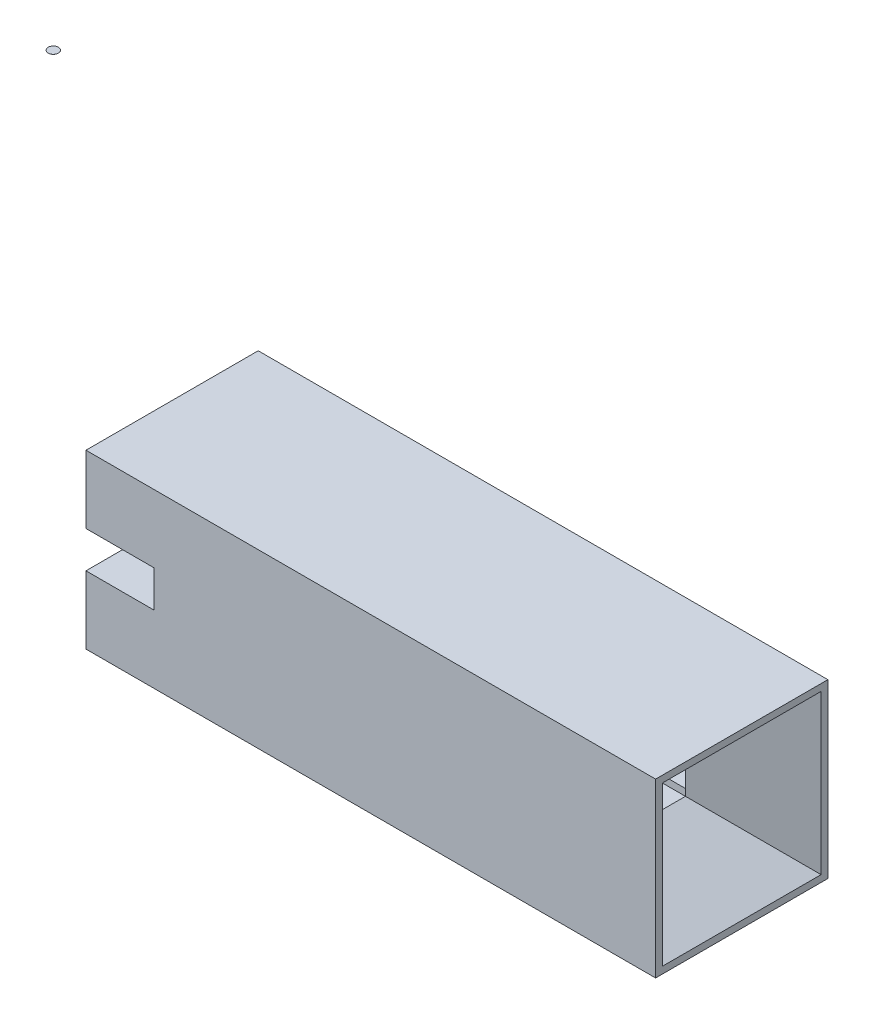
ISO-10303-21;
HEADER;
FILE_DESCRIPTION(('STEP AP214'),'2;1');
FILE_NAME('part.step','',(''),(''),'','','');
FILE_SCHEMA(('AUTOMOTIVE_DESIGN { 1 0 10303 214 1 1 1 1 }'));
ENDSEC;
DATA;
#1=APPLICATION_CONTEXT('core data for automotive mechanical design processes');
#2=APPLICATION_PROTOCOL_DEFINITION('international standard','automotive_design',2000,#1);
#3=PRODUCT_CONTEXT('',#1,'mechanical');
#4=PRODUCT('Part','Part','',(#3));
#5=PRODUCT_RELATED_PRODUCT_CATEGORY('part','',(#4));
#6=PRODUCT_DEFINITION_FORMATION('','',#4);
#7=PRODUCT_DEFINITION_CONTEXT('part definition',#1,'design');
#8=PRODUCT_DEFINITION('design','',#6,#7);
#9=PRODUCT_DEFINITION_SHAPE('','',#8);
#10=(LENGTH_UNIT() NAMED_UNIT(*) SI_UNIT(.MILLI.,.METRE.));
#11=(NAMED_UNIT(*) PLANE_ANGLE_UNIT() SI_UNIT($,.RADIAN.));
#12=(NAMED_UNIT(*) SI_UNIT($,.STERADIAN.) SOLID_ANGLE_UNIT());
#13=UNCERTAINTY_MEASURE_WITH_UNIT(LENGTH_MEASURE(1.E-05),#10,'distance_accuracy_value','');
#14=(GEOMETRIC_REPRESENTATION_CONTEXT(3) GLOBAL_UNCERTAINTY_ASSIGNED_CONTEXT((#13)) GLOBAL_UNIT_ASSIGNED_CONTEXT((#10,
#11,#12)) REPRESENTATION_CONTEXT('',''));
#15=CARTESIAN_POINT('',(0.,0.,0.));
#16=DIRECTION('',(0.,0.,1.));
#17=DIRECTION('',(1.,0.,0.));
#18=AXIS2_PLACEMENT_3D('',#15,#16,#17);
#19=CARTESIAN_POINT('',(-1.75128642374789,6.13796437451679,1.2700146680412));
#20=DIRECTION('',(0.,-1.,0.));
#21=DIRECTION('',(0.,0.,-1.));
#22=AXIS2_PLACEMENT_3D('',#19,#20,#21);
#23=CYLINDRICAL_SURFACE('',#22,0.0749998832872016);
#24=CARTESIAN_POINT('',(-1.75128642374789,6.13796437451679,1.2700146680412));
#25=DIRECTION('',(-1.06457269215265E-11,0.999999999994676,3.26329213274641E-06));
#26=DIRECTION('',(0.,-3.26329213274641E-06,0.999999999994675));
#27=AXIS2_PLACEMENT_3D('',#24,#25,#26);
#28=CIRCLE('',#27,0.0749998832872016);
#29=CARTESIAN_POINT('',(-1.75128642374789,6.13796412977026,1.345014551328));
#30=VERTEX_POINT('',#29);
#31=EDGE_CURVE('E11',#30,#30,#28,.T.);
#32=ORIENTED_EDGE('',*,*,#31,.F.);
#33=EDGE_LOOP('',(#32));
#34=FACE_BOUND('',#33,.T.);
#35=CARTESIAN_POINT('',(-1.75128642374789,6.13696437451679,1.2700146680412));
#36=DIRECTION('',(-1.06457269215265E-11,0.999999999994676,3.26329213274641E-06));
#37=DIRECTION('',(0.,-3.26329213274641E-06,0.999999999994675));
#38=AXIS2_PLACEMENT_3D('',#35,#36,#37);
#39=CIRCLE('',#38,0.0749998832872016);
#40=CARTESIAN_POINT('',(-1.75128642374789,6.13696412977026,1.345014551328));
#41=VERTEX_POINT('',#40);
#42=EDGE_CURVE('E54',#41,#41,#39,.T.);
#43=ORIENTED_EDGE('',*,*,#42,.T.);
#44=EDGE_LOOP('',(#43));
#45=FACE_BOUND('',#44,.T.);
#46=ADVANCED_FACE('F51',(#34,#45),#23,.T.);
#47=CARTESIAN_POINT('',(-1.75128642374789,6.13796437451679,1.2700146680412));
#48=DIRECTION('',(-1.06457269215265E-11,0.999999999994676,3.26329213274641E-06));
#49=DIRECTION('',(0.,-3.26329213274641E-06,0.999999999994675));
#50=AXIS2_PLACEMENT_3D('',#47,#48,#49);
#51=PLANE('',#50);
#52=ORIENTED_EDGE('',*,*,#31,.T.);
#53=EDGE_LOOP('',(#52));
#54=FACE_BOUND('',#53,.T.);
#55=ADVANCED_FACE('F66',(#54),#51,.T.);
#56=CARTESIAN_POINT('',(-1.75128642374789,6.13696437451679,1.2700146680412));
#57=DIRECTION('',(-1.06457269215265E-11,0.999999999994676,3.26329213274641E-06));
#58=DIRECTION('',(0.,-3.26329213274641E-06,0.999999999994675));
#59=AXIS2_PLACEMENT_3D('',#56,#57,#58);
#60=PLANE('',#59);
#61=ORIENTED_EDGE('',*,*,#42,.F.);
#62=EDGE_LOOP('',(#61));
#63=FACE_BOUND('',#62,.T.);
#64=ADVANCED_FACE('F64',(#63),#60,.F.);
#65=CLOSED_SHELL('',(#46,#55,#64));
#66=MANIFOLD_SOLID_BREP('B2',#65);
#67=CARTESIAN_POINT('',(-0.000999999999999265,1.64,1.64));
#68=DIRECTION('',(0.,0.,1.));
#69=DIRECTION('',(1.,0.,0.));
#70=AXIS2_PLACEMENT_3D('',#67,#68,#69);
#71=PLANE('',#70);
#72=DIRECTION('',(1.,0.,0.));
#73=VECTOR('',#72,1.);
#74=CARTESIAN_POINT('',(-0.000999999999999265,1.,1.64));
#75=LINE('',#74,#73);
#76=CARTESIAN_POINT('',(0.,1.,1.64));
#77=VERTEX_POINT('',#76);
#78=CARTESIAN_POINT('',(7.2,1.,1.64));
#79=VERTEX_POINT('',#78);
#80=EDGE_CURVE('E330',#77,#79,#75,.T.);
#81=ORIENTED_EDGE('',*,*,#80,.T.);
#82=DIRECTION('',(0.,-1.,0.));
#83=VECTOR('',#82,1.);
#84=CARTESIAN_POINT('',(7.2,1.64000000000001,1.64));
#85=LINE('',#84,#83);
#86=CARTESIAN_POINT('',(7.20000000000001,0.9,1.64));
#87=VERTEX_POINT('',#86);
#88=EDGE_CURVE('E421',#79,#87,#85,.T.);
#89=ORIENTED_EDGE('',*,*,#88,.T.);
#90=DIRECTION('',(1.,0.,0.));
#91=VECTOR('',#90,1.);
#92=CARTESIAN_POINT('',(-0.000999999999999265,0.9,1.64));
#93=LINE('',#92,#91);
#94=CARTESIAN_POINT('',(0.,0.9,1.64));
#95=VERTEX_POINT('',#94);
#96=EDGE_CURVE('E358',#95,#87,#93,.T.);
#97=ORIENTED_EDGE('',*,*,#96,.F.);
#98=DIRECTION('',(0.,1.,0.));
#99=VECTOR('',#98,1.);
#100=CARTESIAN_POINT('',(0.,1.64,1.64));
#101=LINE('',#100,#99);
#102=EDGE_CURVE('E354',#95,#77,#101,.T.);
#103=ORIENTED_EDGE('',*,*,#102,.T.);
#104=EDGE_LOOP('',(#81,#89,#97,#103));
#105=FACE_BOUND('',#104,.T.);
#106=ADVANCED_FACE('F97',(#105),#71,.F.);
#107=CARTESIAN_POINT('',(-0.000999999999999265,1.64,0.9));
#108=DIRECTION('',(0.,0.,-1.));
#109=DIRECTION('',(0.,1.,0.));
#110=AXIS2_PLACEMENT_3D('',#107,#108,#109);
#111=PLANE('',#110);
#112=DIRECTION('',(0.,1.,0.));
#113=VECTOR('',#112,1.);
#114=CARTESIAN_POINT('',(7.2,1.64000000000001,0.9));
#115=LINE('',#114,#113);
#116=CARTESIAN_POINT('',(7.2,0.900000000000011,0.9));
#117=VERTEX_POINT('',#116);
#118=CARTESIAN_POINT('',(7.2,1.,0.900000000000001));
#119=VERTEX_POINT('',#118);
#120=EDGE_CURVE('E443',#117,#119,#115,.T.);
#121=ORIENTED_EDGE('',*,*,#120,.T.);
#122=DIRECTION('',(-1.,0.,0.));
#123=VECTOR('',#122,1.);
#124=CARTESIAN_POINT('',(-0.000999999999999265,1.,0.9));
#125=LINE('',#124,#123);
#126=CARTESIAN_POINT('',(0.,1.,0.9));
#127=VERTEX_POINT('',#126);
#128=EDGE_CURVE('E106',#119,#127,#125,.T.);
#129=ORIENTED_EDGE('',*,*,#128,.T.);
#130=DIRECTION('',(0.,-1.,0.));
#131=VECTOR('',#130,1.);
#132=CARTESIAN_POINT('',(0.,1.64,0.9));
#133=LINE('',#132,#131);
#134=CARTESIAN_POINT('',(0.,0.900000000000011,0.9));
#135=VERTEX_POINT('',#134);
#136=EDGE_CURVE('E349',#127,#135,#133,.T.);
#137=ORIENTED_EDGE('',*,*,#136,.T.);
#138=DIRECTION('',(1.,0.,0.));
#139=VECTOR('',#138,1.);
#140=CARTESIAN_POINT('',(-0.000999999999999265,0.900000000000011,0.9));
#141=LINE('',#140,#139);
#142=EDGE_CURVE('E367',#135,#117,#141,.T.);
#143=ORIENTED_EDGE('',*,*,#142,.T.);
#144=EDGE_LOOP('',(#121,#129,#137,#143));
#145=FACE_BOUND('',#144,.T.);
#146=ADVANCED_FACE('F467',(#145),#111,.F.);
#147=CARTESIAN_POINT('',(0.,0.,2.54));
#148=DIRECTION('',(1.,0.,0.));
#149=DIRECTION('',(0.,0.,-1.));
#150=AXIS2_PLACEMENT_3D('',#147,#148,#149);
#151=PLANE('',#150);
#152=DIRECTION('',(0.,-1.,0.));
#153=VECTOR('',#152,1.);
#154=CARTESIAN_POINT('',(0.,0.,0.));
#155=LINE('',#154,#153);
#156=CARTESIAN_POINT('',(0.,2.54,0.));
#157=VERTEX_POINT('',#156);
#158=CARTESIAN_POINT('',(0.,1.54,0.));
#159=VERTEX_POINT('',#158);
#160=EDGE_CURVE('E393',#157,#159,#155,.T.);
#161=ORIENTED_EDGE('',*,*,#160,.T.);
#162=DIRECTION('',(0.,0.,-1.));
#163=VECTOR('',#162,1.);
#164=CARTESIAN_POINT('',(0.,1.54,0.));
#165=LINE('',#164,#163);
#166=CARTESIAN_POINT('',(0.,1.54,0.9));
#167=VERTEX_POINT('',#166);
#168=EDGE_CURVE('E323',#167,#159,#165,.T.);
#169=ORIENTED_EDGE('',*,*,#168,.F.);
#170=CARTESIAN_POINT('',(0.,1.64,0.9));
#171=VERTEX_POINT('',#170);
#172=EDGE_CURVE('E344',#171,#167,#133,.T.);
#173=ORIENTED_EDGE('',*,*,#172,.F.);
#174=DIRECTION('',(0.,0.,-1.));
#175=VECTOR('',#174,1.);
#176=CARTESIAN_POINT('',(0.,1.64,1.64));
#177=LINE('',#176,#175);
#178=CARTESIAN_POINT('',(0.,1.64,1.64));
#179=VERTEX_POINT('',#178);
#180=EDGE_CURVE('E348',#179,#171,#177,.T.);
#181=ORIENTED_EDGE('',*,*,#180,.F.);
#182=CARTESIAN_POINT('',(0.,1.54,1.64));
#183=VERTEX_POINT('',#182);
#184=EDGE_CURVE('E353',#183,#179,#101,.T.);
#185=ORIENTED_EDGE('',*,*,#184,.F.);
#186=CARTESIAN_POINT('',(0.,1.54,2.54));
#187=VERTEX_POINT('',#186);
#188=EDGE_CURVE('E307',#187,#183,#165,.T.);
#189=ORIENTED_EDGE('',*,*,#188,.F.);
#190=DIRECTION('',(0.,-1.,0.));
#191=VECTOR('',#190,1.);
#192=CARTESIAN_POINT('',(0.,0.,2.54));
#193=LINE('',#192,#191);
#194=CARTESIAN_POINT('',(0.,2.54,2.54));
#195=VERTEX_POINT('',#194);
#196=EDGE_CURVE('E378',#195,#187,#193,.T.);
#197=ORIENTED_EDGE('',*,*,#196,.F.);
#198=DIRECTION('',(0.,0.,-1.));
#199=VECTOR('',#198,1.);
#200=CARTESIAN_POINT('',(0.,2.54,2.54));
#201=LINE('',#200,#199);
#202=EDGE_CURVE('E392',#195,#157,#201,.T.);
#203=ORIENTED_EDGE('',*,*,#202,.T.);
#204=EDGE_LOOP('',(#161,#169,#173,#181,#185,#189,#197,#203));
#205=FACE_BOUND('',#204,.T.);
#206=ADVANCED_FACE('F556',(#205),#151,.F.);
#207=CARTESIAN_POINT('',(0.,1.,2.54));
#208=VERTEX_POINT('',#207);
#209=CARTESIAN_POINT('',(0.,0.,2.54));
#210=VERTEX_POINT('',#209);
#211=EDGE_CURVE('E383',#208,#210,#193,.T.);
#212=ORIENTED_EDGE('',*,*,#211,.F.);
#213=DIRECTION('',(0.,0.,1.));
#214=VECTOR('',#213,1.);
#215=CARTESIAN_POINT('',(0.,1.,0.));
#216=LINE('',#215,#214);
#217=EDGE_CURVE('E301',#77,#208,#216,.T.);
#218=ORIENTED_EDGE('',*,*,#217,.F.);
#219=ORIENTED_EDGE('',*,*,#102,.F.);
#220=DIRECTION('',(0.,0.,1.));
#221=VECTOR('',#220,1.);
#222=CARTESIAN_POINT('',(0.,0.9,1.64));
#223=LINE('',#222,#221);
#224=EDGE_CURVE('E363',#135,#95,#223,.T.);
#225=ORIENTED_EDGE('',*,*,#224,.F.);
#226=ORIENTED_EDGE('',*,*,#136,.F.);
#227=CARTESIAN_POINT('',(0.,1.,0.));
#228=VERTEX_POINT('',#227);
#229=EDGE_CURVE('E320',#228,#127,#216,.T.);
#230=ORIENTED_EDGE('',*,*,#229,.F.);
#231=CARTESIAN_POINT('',(0.,0.,0.));
#232=VERTEX_POINT('',#231);
#233=EDGE_CURVE('E377',#228,#232,#155,.T.);
#234=ORIENTED_EDGE('',*,*,#233,.T.);
#235=DIRECTION('',(0.,0.,-1.));
#236=VECTOR('',#235,1.);
#237=CARTESIAN_POINT('',(0.,0.,2.54));
#238=LINE('',#237,#236);
#239=EDGE_CURVE('E417',#210,#232,#238,.T.);
#240=ORIENTED_EDGE('',*,*,#239,.F.);
#241=EDGE_LOOP('',(#212,#218,#219,#225,#226,#230,#234,#240));
#242=FACE_BOUND('',#241,.T.);
#243=ADVANCED_FACE('F476',(#242),#151,.F.);
#244=CARTESIAN_POINT('',(0.,0.,2.54));
#245=DIRECTION('',(0.,1.,0.));
#246=DIRECTION('',(0.,0.,1.));
#247=AXIS2_PLACEMENT_3D('',#244,#245,#246);
#248=PLANE('',#247);
#249=DIRECTION('',(1.,0.,0.));
#250=VECTOR('',#249,1.);
#251=CARTESIAN_POINT('',(0.,0.,0.));
#252=LINE('',#251,#250);
#253=CARTESIAN_POINT('',(8.4,0.,0.));
#254=VERTEX_POINT('',#253);
#255=EDGE_CURVE('E397',#232,#254,#252,.T.);
#256=ORIENTED_EDGE('',*,*,#255,.T.);
#257=DIRECTION('',(0.,0.,-1.));
#258=VECTOR('',#257,1.);
#259=CARTESIAN_POINT('',(8.4,0.,2.54));
#260=LINE('',#259,#258);
#261=CARTESIAN_POINT('',(8.4,0.,2.54));
#262=VERTEX_POINT('',#261);
#263=EDGE_CURVE('E413',#262,#254,#260,.T.);
#264=ORIENTED_EDGE('',*,*,#263,.F.);
#265=DIRECTION('',(1.,0.,0.));
#266=VECTOR('',#265,1.);
#267=CARTESIAN_POINT('',(0.,0.,2.54));
#268=LINE('',#267,#266);
#269=EDGE_CURVE('E382',#210,#262,#268,.T.);
#270=ORIENTED_EDGE('',*,*,#269,.F.);
#271=ORIENTED_EDGE('',*,*,#239,.T.);
#272=EDGE_LOOP('',(#256,#264,#270,#271));
#273=FACE_BOUND('',#272,.T.);
#274=ADVANCED_FACE('F543',(#273),#248,.F.);
#275=CARTESIAN_POINT('',(8.4,0.,2.54));
#276=DIRECTION('',(-1.,0.,0.));
#277=DIRECTION('',(0.,-1.,0.));
#278=AXIS2_PLACEMENT_3D('',#275,#276,#277);
#279=PLANE('',#278);
#280=DIRECTION('',(0.,0.,1.));
#281=VECTOR('',#280,1.);
#282=CARTESIAN_POINT('',(8.4,0.09999999999999,2.54));
#283=LINE('',#282,#281);
#284=CARTESIAN_POINT('',(8.4,0.100000000000028,0.100000000000002));
#285=VERTEX_POINT('',#284);
#286=CARTESIAN_POINT('',(8.4,0.0999999999999915,2.44));
#287=VERTEX_POINT('',#286);
#288=EDGE_CURVE('E433',#285,#287,#283,.T.);
#289=ORIENTED_EDGE('',*,*,#288,.T.);
#290=DIRECTION('',(0.,1.,0.));
#291=VECTOR('',#290,1.);
#292=CARTESIAN_POINT('',(8.4,0.,2.44));
#293=LINE('',#292,#291);
#294=CARTESIAN_POINT('',(8.4,2.44,2.44));
#295=VERTEX_POINT('',#294);
#296=EDGE_CURVE('E436',#287,#295,#293,.T.);
#297=ORIENTED_EDGE('',*,*,#296,.T.);
#298=DIRECTION('',(0.,0.,-1.));
#299=VECTOR('',#298,1.);
#300=CARTESIAN_POINT('',(8.4,2.44,2.54));
#301=LINE('',#300,#299);
#302=CARTESIAN_POINT('',(8.4,2.44,0.100000000000002));
#303=VERTEX_POINT('',#302);
#304=EDGE_CURVE('E426',#295,#303,#301,.T.);
#305=ORIENTED_EDGE('',*,*,#304,.T.);
#306=DIRECTION('',(0.,-1.,0.));
#307=VECTOR('',#306,1.);
#308=CARTESIAN_POINT('',(8.4,0.,0.100000000000002));
#309=LINE('',#308,#307);
#310=EDGE_CURVE('E430',#303,#285,#309,.T.);
#311=ORIENTED_EDGE('',*,*,#310,.T.);
#312=EDGE_LOOP('',(#289,#297,#305,#311));
#313=FACE_BOUND('',#312,.T.);
#314=DIRECTION('',(0.,1.,0.));
#315=VECTOR('',#314,1.);
#316=CARTESIAN_POINT('',(8.4,0.,0.));
#317=LINE('',#316,#315);
#318=CARTESIAN_POINT('',(8.4,2.54,0.));
#319=VERTEX_POINT('',#318);
#320=EDGE_CURVE('E400',#254,#319,#317,.T.);
#321=ORIENTED_EDGE('',*,*,#320,.T.);
#322=DIRECTION('',(0.,0.,-1.));
#323=VECTOR('',#322,1.);
#324=CARTESIAN_POINT('',(8.4,2.54,2.54));
#325=LINE('',#324,#323);
#326=CARTESIAN_POINT('',(8.4,2.54,2.54));
#327=VERTEX_POINT('',#326);
#328=EDGE_CURVE('E409',#327,#319,#325,.T.);
#329=ORIENTED_EDGE('',*,*,#328,.F.);
#330=DIRECTION('',(0.,1.,0.));
#331=VECTOR('',#330,1.);
#332=CARTESIAN_POINT('',(8.4,0.,2.54));
#333=LINE('',#332,#331);
#334=EDGE_CURVE('E386',#262,#327,#333,.T.);
#335=ORIENTED_EDGE('',*,*,#334,.F.);
#336=ORIENTED_EDGE('',*,*,#263,.T.);
#337=EDGE_LOOP('',(#321,#329,#335,#336));
#338=FACE_BOUND('',#337,.T.);
#339=ADVANCED_FACE('F550',(#313,#338),#279,.F.);
#340=CARTESIAN_POINT('',(0.,2.54,2.54));
#341=DIRECTION('',(0.,-1.,0.));
#342=DIRECTION('',(0.,0.,-1.));
#343=AXIS2_PLACEMENT_3D('',#340,#341,#342);
#344=PLANE('',#343);
#345=DIRECTION('',(-1.,0.,0.));
#346=VECTOR('',#345,1.);
#347=CARTESIAN_POINT('',(0.,2.54,0.));
#348=LINE('',#347,#346);
#349=EDGE_CURVE('E403',#319,#157,#348,.T.);
#350=ORIENTED_EDGE('',*,*,#349,.T.);
#351=ORIENTED_EDGE('',*,*,#202,.F.);
#352=DIRECTION('',(-1.,0.,0.));
#353=VECTOR('',#352,1.);
#354=CARTESIAN_POINT('',(0.,2.54,2.54));
#355=LINE('',#354,#353);
#356=EDGE_CURVE('E389',#327,#195,#355,.T.);
#357=ORIENTED_EDGE('',*,*,#356,.F.);
#358=ORIENTED_EDGE('',*,*,#328,.T.);
#359=EDGE_LOOP('',(#350,#351,#357,#358));
#360=FACE_BOUND('',#359,.T.);
#361=ADVANCED_FACE('F554',(#360),#344,.F.);
#362=CARTESIAN_POINT('',(0.,0.,2.54));
#363=DIRECTION('',(0.,0.,-1.));
#364=DIRECTION('',(-1.,0.,0.));
#365=AXIS2_PLACEMENT_3D('',#362,#363,#364);
#366=PLANE('',#365);
#367=ORIENTED_EDGE('',*,*,#196,.T.);
#368=DIRECTION('',(-1.,0.,0.));
#369=VECTOR('',#368,1.);
#370=CARTESIAN_POINT('',(1.,1.54,2.54));
#371=LINE('',#370,#369);
#372=CARTESIAN_POINT('',(1.,1.54,2.54));
#373=VERTEX_POINT('',#372);
#374=EDGE_CURVE('E331',#373,#187,#371,.T.);
#375=ORIENTED_EDGE('',*,*,#374,.F.);
#376=DIRECTION('',(0.,1.,0.));
#377=VECTOR('',#376,1.);
#378=CARTESIAN_POINT('',(1.,1.54,2.54));
#379=LINE('',#378,#377);
#380=CARTESIAN_POINT('',(1.,1.,2.54));
#381=VERTEX_POINT('',#380);
#382=EDGE_CURVE('E312',#381,#373,#379,.T.);
#383=ORIENTED_EDGE('',*,*,#382,.F.);
#384=DIRECTION('',(-1.,0.,0.));
#385=VECTOR('',#384,1.);
#386=CARTESIAN_POINT('',(1.,1.,2.54));
#387=LINE('',#386,#385);
#388=EDGE_CURVE('E334',#381,#208,#387,.T.);
#389=ORIENTED_EDGE('',*,*,#388,.T.);
#390=ORIENTED_EDGE('',*,*,#211,.T.);
#391=ORIENTED_EDGE('',*,*,#269,.T.);
#392=ORIENTED_EDGE('',*,*,#334,.T.);
#393=ORIENTED_EDGE('',*,*,#356,.T.);
#394=EDGE_LOOP('',(#367,#375,#383,#389,#390,#391,#392,#393));
#395=FACE_BOUND('',#394,.T.);
#396=ADVANCED_FACE('F537',(#395),#366,.F.);
#397=CARTESIAN_POINT('',(0.,0.,0.));
#398=DIRECTION('',(0.,0.,-1.));
#399=DIRECTION('',(-1.,0.,0.));
#400=AXIS2_PLACEMENT_3D('',#397,#398,#399);
#401=PLANE('',#400);
#402=DIRECTION('',(-1.,0.,0.));
#403=VECTOR('',#402,1.);
#404=CARTESIAN_POINT('',(1.,1.54,0.));
#405=LINE('',#404,#403);
#406=CARTESIAN_POINT('',(1.,1.54,0.));
#407=VERTEX_POINT('',#406);
#408=EDGE_CURVE('E326',#407,#159,#405,.T.);
#409=ORIENTED_EDGE('',*,*,#408,.T.);
#410=ORIENTED_EDGE('',*,*,#160,.F.);
#411=ORIENTED_EDGE('',*,*,#349,.F.);
#412=ORIENTED_EDGE('',*,*,#320,.F.);
#413=ORIENTED_EDGE('',*,*,#255,.F.);
#414=ORIENTED_EDGE('',*,*,#233,.F.);
#415=DIRECTION('',(-1.,0.,0.));
#416=VECTOR('',#415,1.);
#417=CARTESIAN_POINT('',(1.,1.,0.));
#418=LINE('',#417,#416);
#419=CARTESIAN_POINT('',(1.,1.,0.));
#420=VERTEX_POINT('',#419);
#421=EDGE_CURVE('E319',#420,#228,#418,.T.);
#422=ORIENTED_EDGE('',*,*,#421,.F.);
#423=DIRECTION('',(0.,-1.,0.));
#424=VECTOR('',#423,1.);
#425=CARTESIAN_POINT('',(1.,1.54,0.));
#426=LINE('',#425,#424);
#427=EDGE_CURVE('E302',#407,#420,#426,.T.);
#428=ORIENTED_EDGE('',*,*,#427,.F.);
#429=EDGE_LOOP('',(#409,#410,#411,#412,#413,#414,#422,#428));
#430=FACE_BOUND('',#429,.T.);
#431=ADVANCED_FACE('F499',(#430),#401,.T.);
#432=CARTESIAN_POINT('',(7.2,1.64,1.64));
#433=VERTEX_POINT('',#432);
#434=CARTESIAN_POINT('',(7.2,1.54,1.64));
#435=VERTEX_POINT('',#434);
#436=EDGE_CURVE('E422',#433,#435,#85,.T.);
#437=ORIENTED_EDGE('',*,*,#436,.T.);
#438=DIRECTION('',(-1.,0.,0.));
#439=VECTOR('',#438,1.);
#440=CARTESIAN_POINT('',(-0.000999999999999265,1.54,1.64));
#441=LINE('',#440,#439);
#442=EDGE_CURVE('E260',#435,#183,#441,.T.);
#443=ORIENTED_EDGE('',*,*,#442,.T.);
#444=ORIENTED_EDGE('',*,*,#184,.T.);
#445=DIRECTION('',(1.,0.,0.));
#446=VECTOR('',#445,1.);
#447=CARTESIAN_POINT('',(-0.000999999999999265,1.64,1.64));
#448=LINE('',#447,#446);
#449=EDGE_CURVE('E359',#179,#433,#448,.T.);
#450=ORIENTED_EDGE('',*,*,#449,.T.);
#451=EDGE_LOOP('',(#437,#443,#444,#450));
#452=FACE_BOUND('',#451,.T.);
#453=ADVANCED_FACE('F523',(#452),#71,.F.);
#454=CARTESIAN_POINT('',(-0.000999999999999265,1.64,1.64));
#455=DIRECTION('',(0.,1.,0.));
#456=DIRECTION('',(0.,0.,1.));
#457=AXIS2_PLACEMENT_3D('',#454,#455,#456);
#458=PLANE('',#457);
#459=DIRECTION('',(1.,0.,0.));
#460=VECTOR('',#459,1.);
#461=CARTESIAN_POINT('',(-0.000999999999999265,1.64,0.9));
#462=LINE('',#461,#460);
#463=CARTESIAN_POINT('',(7.2,1.64,0.9));
#464=VERTEX_POINT('',#463);
#465=EDGE_CURVE('E364',#171,#464,#462,.T.);
#466=ORIENTED_EDGE('',*,*,#465,.T.);
#467=DIRECTION('',(0.,0.,1.));
#468=VECTOR('',#467,1.);
#469=CARTESIAN_POINT('',(7.2,1.64,1.64));
#470=LINE('',#469,#468);
#471=EDGE_CURVE('E447',#464,#433,#470,.T.);
#472=ORIENTED_EDGE('',*,*,#471,.T.);
#473=ORIENTED_EDGE('',*,*,#449,.F.);
#474=ORIENTED_EDGE('',*,*,#180,.T.);
#475=EDGE_LOOP('',(#466,#472,#473,#474));
#476=FACE_BOUND('',#475,.T.);
#477=ADVANCED_FACE('F520',(#476),#458,.F.);
#478=DIRECTION('',(1.,0.,0.));
#479=VECTOR('',#478,1.);
#480=CARTESIAN_POINT('',(-0.000999999999999265,1.54,0.9));
#481=LINE('',#480,#479);
#482=CARTESIAN_POINT('',(7.2,1.54,0.900000000000001));
#483=VERTEX_POINT('',#482);
#484=EDGE_CURVE('E49',#167,#483,#481,.T.);
#485=ORIENTED_EDGE('',*,*,#484,.T.);
#486=EDGE_CURVE('E120',#483,#464,#115,.T.);
#487=ORIENTED_EDGE('',*,*,#486,.T.);
#488=ORIENTED_EDGE('',*,*,#465,.F.);
#489=ORIENTED_EDGE('',*,*,#172,.T.);
#490=EDGE_LOOP('',(#485,#487,#488,#489));
#491=FACE_BOUND('',#490,.T.);
#492=ADVANCED_FACE('F587',(#491),#111,.F.);
#493=CARTESIAN_POINT('',(-0.000999999999999265,0.9,1.64));
#494=DIRECTION('',(0.,-1.,0.));
#495=DIRECTION('',(0.,0.,-1.));
#496=AXIS2_PLACEMENT_3D('',#493,#494,#495);
#497=PLANE('',#496);
#498=ORIENTED_EDGE('',*,*,#96,.T.);
#499=DIRECTION('',(0.,0.,-1.));
#500=VECTOR('',#499,1.);
#501=CARTESIAN_POINT('',(7.20000000000001,0.9,1.64));
#502=LINE('',#501,#500);
#503=EDGE_CURVE('E440',#87,#117,#502,.T.);
#504=ORIENTED_EDGE('',*,*,#503,.T.);
#505=ORIENTED_EDGE('',*,*,#142,.F.);
#506=ORIENTED_EDGE('',*,*,#224,.T.);
#507=EDGE_LOOP('',(#498,#504,#505,#506));
#508=FACE_BOUND('',#507,.T.);
#509=ADVANCED_FACE('F568',(#508),#497,.F.);
#510=CARTESIAN_POINT('',(7.2,1.64000000000001,0.9));
#511=DIRECTION('',(-0.554700196225228,0.,-0.832050294337844));
#512=DIRECTION('',(0.,1.,0.));
#513=AXIS2_PLACEMENT_3D('',#510,#511,#512);
#514=PLANE('',#513);
#515=DIRECTION('',(0.727606875109003,-0.485071250072659,-0.485071250072667));
#516=VECTOR('',#515,1.);
#517=CARTESIAN_POINT('',(6.93882352941177,1.07411764705883,1.07411764705882));
#518=LINE('',#517,#516);
#519=EDGE_CURVE('E456',#285,#117,#518,.F.);
#520=ORIENTED_EDGE('',*,*,#519,.F.);
#521=ORIENTED_EDGE('',*,*,#310,.F.);
#522=DIRECTION('',(0.727606875108999,0.485071250072666,-0.485071250072665));
#523=VECTOR('',#522,1.);
#524=CARTESIAN_POINT('',(7.20000000000001,1.64,0.899999999999998));
#525=LINE('',#524,#523);
#526=EDGE_CURVE('E460',#464,#303,#525,.T.);
#527=ORIENTED_EDGE('',*,*,#526,.F.);
#528=ORIENTED_EDGE('',*,*,#486,.F.);
#529=DIRECTION('',(0.,1.,0.));
#530=VECTOR('',#529,1.);
#531=CARTESIAN_POINT('',(7.2,1.64000000000001,0.900000000000001));
#532=LINE('',#531,#530);
#533=EDGE_CURVE('E292',#483,#119,#532,.F.);
#534=ORIENTED_EDGE('',*,*,#533,.T.);
#535=ORIENTED_EDGE('',*,*,#120,.F.);
#536=EDGE_LOOP('',(#520,#521,#527,#528,#534,#535));
#537=FACE_BOUND('',#536,.T.);
#538=ADVANCED_FACE('F99',(#537),#514,.F.);
#539=CARTESIAN_POINT('',(7.2,1.64,1.64));
#540=DIRECTION('',(-0.554700196225229,0.832050294337844,0.));
#541=DIRECTION('',(0.,0.,1.));
#542=AXIS2_PLACEMENT_3D('',#539,#540,#541);
#543=PLANE('',#542);
#544=ORIENTED_EDGE('',*,*,#526,.T.);
#545=ORIENTED_EDGE('',*,*,#304,.F.);
#546=DIRECTION('',(-0.727606875108999,-0.485071250072666,-0.485071250072665));
#547=VECTOR('',#546,1.);
#548=CARTESIAN_POINT('',(7.20000000000001,1.64,1.64));
#549=LINE('',#548,#547);
#550=EDGE_CURVE('E453',#433,#295,#549,.F.);
#551=ORIENTED_EDGE('',*,*,#550,.F.);
#552=ORIENTED_EDGE('',*,*,#471,.F.);
#553=EDGE_LOOP('',(#544,#545,#551,#552));
#554=FACE_BOUND('',#553,.T.);
#555=ADVANCED_FACE('F516',(#554),#543,.F.);
#556=CARTESIAN_POINT('',(7.20000000000001,0.9,1.64));
#557=DIRECTION('',(-0.554700196225228,-0.832050294337845,0.));
#558=DIRECTION('',(0.,0.,-1.));
#559=AXIS2_PLACEMENT_3D('',#556,#557,#558);
#560=PLANE('',#559);
#561=ORIENTED_EDGE('',*,*,#519,.T.);
#562=ORIENTED_EDGE('',*,*,#503,.F.);
#563=DIRECTION('',(0.727606875108998,-0.485071250072671,0.485071250072663));
#564=VECTOR('',#563,1.);
#565=CARTESIAN_POINT('',(6.93882352941176,1.07411764705883,1.46588235294117));
#566=LINE('',#565,#564);
#567=EDGE_CURVE('E343',#287,#87,#566,.F.);
#568=ORIENTED_EDGE('',*,*,#567,.F.);
#569=ORIENTED_EDGE('',*,*,#288,.F.);
#570=EDGE_LOOP('',(#561,#562,#568,#569));
#571=FACE_BOUND('',#570,.T.);
#572=ADVANCED_FACE('F571',(#571),#560,.F.);
#573=CARTESIAN_POINT('',(7.2,1.64000000000001,1.64));
#574=DIRECTION('',(-0.554700196225228,0.,0.832050294337844));
#575=DIRECTION('',(0.,-1.,0.));
#576=AXIS2_PLACEMENT_3D('',#573,#574,#575);
#577=PLANE('',#576);
#578=ORIENTED_EDGE('',*,*,#550,.T.);
#579=ORIENTED_EDGE('',*,*,#296,.F.);
#580=ORIENTED_EDGE('',*,*,#567,.T.);
#581=ORIENTED_EDGE('',*,*,#88,.F.);
#582=EDGE_CURVE('E427',#435,#79,#85,.T.);
#583=ORIENTED_EDGE('',*,*,#582,.F.);
#584=ORIENTED_EDGE('',*,*,#436,.F.);
#585=EDGE_LOOP('',(#578,#579,#580,#581,#583,#584));
#586=FACE_BOUND('',#585,.T.);
#587=ADVANCED_FACE('F562',(#586),#577,.F.);
#588=CARTESIAN_POINT('',(1.,0.,0.));
#589=DIRECTION('',(-1.,0.,0.));
#590=DIRECTION('',(0.,0.,1.));
#591=AXIS2_PLACEMENT_3D('',#588,#589,#590);
#592=PLANE('',#591);
#593=DIRECTION('',(0.,-1.,0.));
#594=VECTOR('',#593,1.);
#595=CARTESIAN_POINT('',(1.,1.,0.4));
#596=LINE('',#595,#594);
#597=CARTESIAN_POINT('',(1.,1.54,0.4));
#598=VERTEX_POINT('',#597);
#599=CARTESIAN_POINT('',(1.,1.,0.4));
#600=VERTEX_POINT('',#599);
#601=EDGE_CURVE('E273',#598,#600,#596,.T.);
#602=ORIENTED_EDGE('',*,*,#601,.F.);
#603=DIRECTION('',(0.,0.,-1.));
#604=VECTOR('',#603,1.);
#605=CARTESIAN_POINT('',(1.,1.54,0.));
#606=LINE('',#605,#604);
#607=EDGE_CURVE('E315',#598,#407,#606,.T.);
#608=ORIENTED_EDGE('',*,*,#607,.T.);
#609=ORIENTED_EDGE('',*,*,#427,.T.);
#610=DIRECTION('',(0.,0.,1.));
#611=VECTOR('',#610,1.);
#612=CARTESIAN_POINT('',(1.,1.,0.));
#613=LINE('',#612,#611);
#614=EDGE_CURVE('E308',#420,#600,#613,.T.);
#615=ORIENTED_EDGE('',*,*,#614,.T.);
#616=EDGE_LOOP('',(#602,#608,#609,#615));
#617=FACE_BOUND('',#616,.T.);
#618=ADVANCED_FACE('F490',(#617),#592,.T.);
#619=CARTESIAN_POINT('',(1.,1.,0.));
#620=DIRECTION('',(0.,-1.,0.));
#621=DIRECTION('',(0.,0.,-1.));
#622=AXIS2_PLACEMENT_3D('',#619,#620,#621);
#623=PLANE('',#622);
#624=ORIENTED_EDGE('',*,*,#614,.F.);
#625=ORIENTED_EDGE('',*,*,#421,.T.);
#626=ORIENTED_EDGE('',*,*,#229,.T.);
#627=ORIENTED_EDGE('',*,*,#128,.F.);
#628=DIRECTION('',(0.,0.,1.));
#629=VECTOR('',#628,1.);
#630=CARTESIAN_POINT('',(7.2,1.,2.14));
#631=LINE('',#630,#629);
#632=CARTESIAN_POINT('',(7.2,1.,0.4));
#633=VERTEX_POINT('',#632);
#634=EDGE_CURVE('E254',#633,#119,#631,.T.);
#635=ORIENTED_EDGE('',*,*,#634,.F.);
#636=DIRECTION('',(-1.,0.,0.));
#637=VECTOR('',#636,1.);
#638=CARTESIAN_POINT('',(7.2,1.,0.4));
#639=LINE('',#638,#637);
#640=EDGE_CURVE('E293',#633,#600,#639,.T.);
#641=ORIENTED_EDGE('',*,*,#640,.T.);
#642=EDGE_LOOP('',(#624,#625,#626,#627,#635,#641));
#643=FACE_BOUND('',#642,.T.);
#644=ADVANCED_FACE('F501',(#643),#623,.F.);
#645=CARTESIAN_POINT('',(1.,1.54,0.));
#646=DIRECTION('',(0.,1.,0.));
#647=DIRECTION('',(0.,0.,1.));
#648=AXIS2_PLACEMENT_3D('',#645,#646,#647);
#649=PLANE('',#648);
#650=ORIENTED_EDGE('',*,*,#168,.T.);
#651=ORIENTED_EDGE('',*,*,#408,.F.);
#652=ORIENTED_EDGE('',*,*,#607,.F.);
#653=DIRECTION('',(-1.,0.,0.));
#654=VECTOR('',#653,1.);
#655=CARTESIAN_POINT('',(7.2,1.54,0.4));
#656=LINE('',#655,#654);
#657=CARTESIAN_POINT('',(7.2,1.54,0.4));
#658=VERTEX_POINT('',#657);
#659=EDGE_CURVE('E253',#658,#598,#656,.T.);
#660=ORIENTED_EDGE('',*,*,#659,.F.);
#661=DIRECTION('',(0.,0.,-1.));
#662=VECTOR('',#661,1.);
#663=CARTESIAN_POINT('',(7.2,1.54,2.14));
#664=LINE('',#663,#662);
#665=EDGE_CURVE('E266',#483,#658,#664,.T.);
#666=ORIENTED_EDGE('',*,*,#665,.F.);
#667=ORIENTED_EDGE('',*,*,#484,.F.);
#668=EDGE_LOOP('',(#650,#651,#652,#660,#666,#667));
#669=FACE_BOUND('',#668,.T.);
#670=ADVANCED_FACE('F495',(#669),#649,.F.);
#671=CARTESIAN_POINT('',(1.,1.54,2.14));
#672=VERTEX_POINT('',#671);
#673=EDGE_CURVE('E316',#373,#672,#606,.T.);
#674=ORIENTED_EDGE('',*,*,#673,.F.);
#675=ORIENTED_EDGE('',*,*,#374,.T.);
#676=ORIENTED_EDGE('',*,*,#188,.T.);
#677=ORIENTED_EDGE('',*,*,#442,.F.);
#678=CARTESIAN_POINT('',(7.2,1.54,2.14));
#679=VERTEX_POINT('',#678);
#680=EDGE_CURVE('E257',#679,#435,#664,.T.);
#681=ORIENTED_EDGE('',*,*,#680,.F.);
#682=DIRECTION('',(-1.,0.,0.));
#683=VECTOR('',#682,1.);
#684=CARTESIAN_POINT('',(7.2,1.54,2.14));
#685=LINE('',#684,#683);
#686=EDGE_CURVE('E244',#679,#672,#685,.T.);
#687=ORIENTED_EDGE('',*,*,#686,.T.);
#688=EDGE_LOOP('',(#674,#675,#676,#677,#681,#687));
#689=FACE_BOUND('',#688,.T.);
#690=ADVANCED_FACE('F258',(#689),#649,.F.);
#691=ORIENTED_EDGE('',*,*,#217,.T.);
#692=ORIENTED_EDGE('',*,*,#388,.F.);
#693=CARTESIAN_POINT('',(1.,1.,2.14));
#694=VERTEX_POINT('',#693);
#695=EDGE_CURVE('E306',#694,#381,#613,.T.);
#696=ORIENTED_EDGE('',*,*,#695,.F.);
#697=DIRECTION('',(-1.,0.,0.));
#698=VECTOR('',#697,1.);
#699=CARTESIAN_POINT('',(7.2,1.,2.14));
#700=LINE('',#699,#698);
#701=CARTESIAN_POINT('',(7.2,1.,2.14));
#702=VERTEX_POINT('',#701);
#703=EDGE_CURVE('E289',#702,#694,#700,.T.);
#704=ORIENTED_EDGE('',*,*,#703,.F.);
#705=EDGE_CURVE('E270',#79,#702,#631,.T.);
#706=ORIENTED_EDGE('',*,*,#705,.F.);
#707=ORIENTED_EDGE('',*,*,#80,.F.);
#708=EDGE_LOOP('',(#691,#692,#696,#704,#706,#707));
#709=FACE_BOUND('',#708,.T.);
#710=ADVANCED_FACE('F533',(#709),#623,.F.);
#711=DIRECTION('',(0.,1.,0.));
#712=VECTOR('',#711,1.);
#713=CARTESIAN_POINT('',(1.,1.,2.14));
#714=LINE('',#713,#712);
#715=EDGE_CURVE('E113',#694,#672,#714,.T.);
#716=ORIENTED_EDGE('',*,*,#715,.F.);
#717=ORIENTED_EDGE('',*,*,#695,.T.);
#718=ORIENTED_EDGE('',*,*,#382,.T.);
#719=ORIENTED_EDGE('',*,*,#673,.T.);
#720=EDGE_LOOP('',(#716,#717,#718,#719));
#721=FACE_BOUND('',#720,.T.);
#722=ADVANCED_FACE('F558',(#721),#592,.T.);
#723=CARTESIAN_POINT('',(7.2,1.,2.14));
#724=DIRECTION('',(0.,0.,1.));
#725=DIRECTION('',(1.,0.,0.));
#726=AXIS2_PLACEMENT_3D('',#723,#724,#725);
#727=PLANE('',#726);
#728=ORIENTED_EDGE('',*,*,#715,.T.);
#729=ORIENTED_EDGE('',*,*,#686,.F.);
#730=DIRECTION('',(0.,1.,0.));
#731=VECTOR('',#730,1.);
#732=CARTESIAN_POINT('',(7.2,1.,2.14));
#733=LINE('',#732,#731);
#734=EDGE_CURVE('E248',#702,#679,#733,.T.);
#735=ORIENTED_EDGE('',*,*,#734,.F.);
#736=ORIENTED_EDGE('',*,*,#703,.T.);
#737=EDGE_LOOP('',(#728,#729,#735,#736));
#738=FACE_BOUND('',#737,.T.);
#739=ADVANCED_FACE('F246',(#738),#727,.F.);
#740=CARTESIAN_POINT('',(7.2,0.,0.));
#741=DIRECTION('',(-1.,0.,0.));
#742=DIRECTION('',(0.,0.,1.));
#743=AXIS2_PLACEMENT_3D('',#740,#741,#742);
#744=PLANE('',#743);
#745=ORIENTED_EDGE('',*,*,#705,.T.);
#746=ORIENTED_EDGE('',*,*,#734,.T.);
#747=ORIENTED_EDGE('',*,*,#680,.T.);
#748=ORIENTED_EDGE('',*,*,#582,.T.);
#749=EDGE_LOOP('',(#745,#746,#747,#748));
#750=FACE_BOUND('',#749,.T.);
#751=ADVANCED_FACE('F268',(#750),#744,.T.);
#752=ORIENTED_EDGE('',*,*,#665,.T.);
#753=DIRECTION('',(0.,-1.,0.));
#754=VECTOR('',#753,1.);
#755=CARTESIAN_POINT('',(7.2,1.,0.4));
#756=LINE('',#755,#754);
#757=EDGE_CURVE('E265',#658,#633,#756,.T.);
#758=ORIENTED_EDGE('',*,*,#757,.T.);
#759=ORIENTED_EDGE('',*,*,#634,.T.);
#760=ORIENTED_EDGE('',*,*,#533,.F.);
#761=EDGE_LOOP('',(#752,#758,#759,#760));
#762=FACE_BOUND('',#761,.T.);
#763=ADVANCED_FACE('F758',(#762),#744,.T.);
#764=CARTESIAN_POINT('',(7.2,1.,0.4));
#765=DIRECTION('',(0.,0.,-1.));
#766=DIRECTION('',(-1.,0.,0.));
#767=AXIS2_PLACEMENT_3D('',#764,#765,#766);
#768=PLANE('',#767);
#769=ORIENTED_EDGE('',*,*,#601,.T.);
#770=ORIENTED_EDGE('',*,*,#640,.F.);
#771=ORIENTED_EDGE('',*,*,#757,.F.);
#772=ORIENTED_EDGE('',*,*,#659,.T.);
#773=EDGE_LOOP('',(#769,#770,#771,#772));
#774=FACE_BOUND('',#773,.T.);
#775=ADVANCED_FACE('F504',(#774),#768,.F.);
#776=CLOSED_SHELL('',(#106,#146,#206,#243,#274,#339,#361,#396,#431,#453,#477,#492,#509,#538,
#555,#572,#587,#618,#644,#670,#690,#710,#722,#739,#751,#763,#775));
#777=MANIFOLD_SOLID_BREP('B6',#776);
#778=ADVANCED_BREP_SHAPE_REPRESENTATION('',(#18,#66,#777),#14);
#779=SHAPE_DEFINITION_REPRESENTATION(#9,#778);
ENDSEC;
END-ISO-10303-21;
